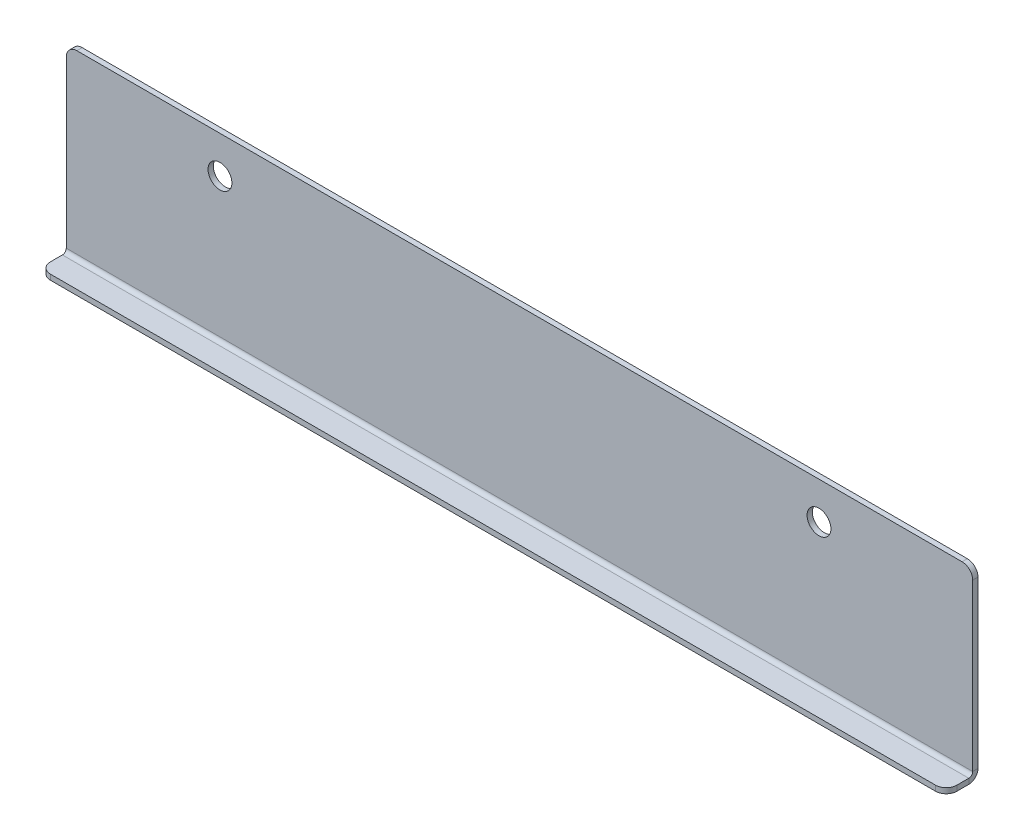
ISO-10303-21;
HEADER;
FILE_DESCRIPTION(('STEP AP214'),'2;1');
FILE_NAME('part.step','',(''),(''),'','','');
FILE_SCHEMA(('AUTOMOTIVE_DESIGN { 1 0 10303 214 1 1 1 1 }'));
ENDSEC;
DATA;
#1=APPLICATION_CONTEXT('core data for automotive mechanical design processes');
#2=APPLICATION_PROTOCOL_DEFINITION('international standard','automotive_design',2000,#1);
#3=PRODUCT_CONTEXT('',#1,'mechanical');
#4=PRODUCT('Part','Part','',(#3));
#5=PRODUCT_RELATED_PRODUCT_CATEGORY('part','',(#4));
#6=PRODUCT_DEFINITION_FORMATION('','',#4);
#7=PRODUCT_DEFINITION_CONTEXT('part definition',#1,'design');
#8=PRODUCT_DEFINITION('design','',#6,#7);
#9=PRODUCT_DEFINITION_SHAPE('','',#8);
#10=(LENGTH_UNIT() NAMED_UNIT(*) SI_UNIT(.MILLI.,.METRE.));
#11=(NAMED_UNIT(*) PLANE_ANGLE_UNIT() SI_UNIT($,.RADIAN.));
#12=(NAMED_UNIT(*) SI_UNIT($,.STERADIAN.) SOLID_ANGLE_UNIT());
#13=UNCERTAINTY_MEASURE_WITH_UNIT(LENGTH_MEASURE(1.E-05),#10,'distance_accuracy_value','');
#14=(GEOMETRIC_REPRESENTATION_CONTEXT(3) GLOBAL_UNCERTAINTY_ASSIGNED_CONTEXT((#13)) GLOBAL_UNIT_ASSIGNED_CONTEXT((#10,
#11,#12)) REPRESENTATION_CONTEXT('',''));
#15=CARTESIAN_POINT('',(0.,0.,0.));
#16=DIRECTION('',(0.,0.,1.));
#17=DIRECTION('',(1.,0.,0.));
#18=AXIS2_PLACEMENT_3D('',#15,#16,#17);
#19=CARTESIAN_POINT('',(85.4999999999999,-20.,-1.));
#20=DIRECTION('',(1.,0.,0.));
#21=DIRECTION('',(0.,0.,-1.));
#22=AXIS2_PLACEMENT_3D('',#19,#20,#21);
#23=PLANE('',#22);
#24=DIRECTION('',(0.,1.,0.));
#25=VECTOR('',#24,1.);
#26=CARTESIAN_POINT('',(85.4999999999999,-20.,-1.));
#27=LINE('',#26,#25);
#28=CARTESIAN_POINT('',(85.4999999999999,-19.2634,-1.));
#29=VERTEX_POINT('',#28);
#30=CARTESIAN_POINT('',(85.4999999999999,12.,-1.));
#31=VERTEX_POINT('',#30);
#32=EDGE_CURVE('E204',#29,#31,#27,.T.);
#33=ORIENTED_EDGE('',*,*,#32,.T.);
#34=DIRECTION('',(0.,0.,1.));
#35=VECTOR('',#34,1.);
#36=CARTESIAN_POINT('',(85.4999999999999,12.,-1.));
#37=LINE('',#36,#35);
#38=CARTESIAN_POINT('',(85.4999999999999,12.,0.));
#39=VERTEX_POINT('',#38);
#40=EDGE_CURVE('E234',#31,#39,#37,.T.);
#41=ORIENTED_EDGE('',*,*,#40,.T.);
#42=DIRECTION('',(0.,1.,0.));
#43=VECTOR('',#42,1.);
#44=CARTESIAN_POINT('',(85.4999999999999,-20.,0.));
#45=LINE('',#44,#43);
#46=CARTESIAN_POINT('',(85.4999999999999,-19.2634,0.));
#47=VERTEX_POINT('',#46);
#48=EDGE_CURVE('E201',#47,#39,#45,.T.);
#49=ORIENTED_EDGE('',*,*,#48,.F.);
#50=DIRECTION('',(0.,0.,-1.));
#51=VECTOR('',#50,1.);
#52=CARTESIAN_POINT('',(85.4999999999999,-19.2634,0.));
#53=LINE('',#52,#51);
#54=EDGE_CURVE('E179',#47,#29,#53,.T.);
#55=ORIENTED_EDGE('',*,*,#54,.T.);
#56=EDGE_LOOP('',(#33,#41,#49,#55));
#57=FACE_BOUND('',#56,.T.);
#58=ADVANCED_FACE('F45',(#57),#23,.T.);
#59=CARTESIAN_POINT('',(0.,0.,-1.));
#60=DIRECTION('',(0.,0.,-1.));
#61=DIRECTION('',(-1.,0.,0.));
#62=AXIS2_PLACEMENT_3D('',#59,#60,#61);
#63=PLANE('',#62);
#64=CARTESIAN_POINT('',(56.5000000000001,7.00000000000001,-1.));
#65=DIRECTION('',(0.,0.,1.));
#66=DIRECTION('',(-1.,0.,0.));
#67=AXIS2_PLACEMENT_3D('',#64,#65,#66);
#68=CIRCLE('',#67,2.25);
#69=CARTESIAN_POINT('',(54.2500000000001,7.00000000000001,-1.));
#70=VERTEX_POINT('',#69);
#71=EDGE_CURVE('E192',#70,#70,#68,.T.);
#72=ORIENTED_EDGE('',*,*,#71,.T.);
#73=EDGE_LOOP('',(#72));
#74=FACE_BOUND('',#73,.T.);
#75=CARTESIAN_POINT('',(-56.5000000000001,7.00000000000001,-1.));
#76=DIRECTION('',(0.,0.,1.));
#77=DIRECTION('',(1.,0.,0.));
#78=AXIS2_PLACEMENT_3D('',#75,#76,#77);
#79=CIRCLE('',#78,2.25);
#80=CARTESIAN_POINT('',(-54.2500000000001,7.00000000000001,-1.));
#81=VERTEX_POINT('',#80);
#82=EDGE_CURVE('E198',#81,#81,#79,.T.);
#83=ORIENTED_EDGE('',*,*,#82,.T.);
#84=EDGE_LOOP('',(#83));
#85=FACE_BOUND('',#84,.T.);
#86=DIRECTION('',(0.,-1.,0.));
#87=VECTOR('',#86,1.);
#88=CARTESIAN_POINT('',(-85.5000000000001,-20.,-1.));
#89=LINE('',#88,#87);
#90=CARTESIAN_POINT('',(-85.5000000000001,12.,-1.));
#91=VERTEX_POINT('',#90);
#92=CARTESIAN_POINT('',(-85.5000000000001,-19.2634,-1.));
#93=VERTEX_POINT('',#92);
#94=EDGE_CURVE('E211',#91,#93,#89,.T.);
#95=ORIENTED_EDGE('',*,*,#94,.F.);
#96=CARTESIAN_POINT('',(-83.5000000000001,12.,-1.));
#97=DIRECTION('',(0.,0.,-1.));
#98=DIRECTION('',(-1.,0.,0.));
#99=AXIS2_PLACEMENT_3D('',#96,#97,#98);
#100=CIRCLE('',#99,2.);
#101=CARTESIAN_POINT('',(-83.5000000000001,14.,-1.));
#102=VERTEX_POINT('',#101);
#103=EDGE_CURVE('E232',#91,#102,#100,.T.);
#104=ORIENTED_EDGE('',*,*,#103,.T.);
#105=DIRECTION('',(-1.,0.,0.));
#106=VECTOR('',#105,1.);
#107=CARTESIAN_POINT('',(-85.5000000000001,14.,-1.));
#108=LINE('',#107,#106);
#109=CARTESIAN_POINT('',(83.4999999999999,14.,-1.));
#110=VERTEX_POINT('',#109);
#111=EDGE_CURVE('E207',#110,#102,#108,.T.);
#112=ORIENTED_EDGE('',*,*,#111,.F.);
#113=CARTESIAN_POINT('',(83.4999999999999,12.,-1.));
#114=DIRECTION('',(0.,0.,-1.));
#115=DIRECTION('',(-1.,0.,0.));
#116=AXIS2_PLACEMENT_3D('',#113,#114,#115);
#117=CIRCLE('',#116,2.);
#118=EDGE_CURVE('E230',#110,#31,#117,.T.);
#119=ORIENTED_EDGE('',*,*,#118,.T.);
#120=ORIENTED_EDGE('',*,*,#32,.F.);
#121=DIRECTION('',(1.,0.,0.));
#122=VECTOR('',#121,1.);
#123=CARTESIAN_POINT('',(85.4999999999999,-19.2634,-1.));
#124=LINE('',#123,#122);
#125=EDGE_CURVE('E145',#29,#93,#124,.F.);
#126=ORIENTED_EDGE('',*,*,#125,.T.);
#127=EDGE_LOOP('',(#95,#104,#112,#119,#120,#126));
#128=FACE_BOUND('',#127,.T.);
#129=ADVANCED_FACE('F299',(#74,#85,#128),#63,.T.);
#130=CARTESIAN_POINT('',(0.,0.,0.));
#131=DIRECTION('',(0.,0.,-1.));
#132=DIRECTION('',(-1.,0.,0.));
#133=AXIS2_PLACEMENT_3D('',#130,#131,#132);
#134=PLANE('',#133);
#135=CARTESIAN_POINT('',(-56.5000000000001,7.00000000000001,0.));
#136=DIRECTION('',(0.,0.,1.));
#137=DIRECTION('',(1.,0.,0.));
#138=AXIS2_PLACEMENT_3D('',#135,#136,#137);
#139=CIRCLE('',#138,2.25);
#140=CARTESIAN_POINT('',(-54.2500000000001,7.00000000000001,0.));
#141=VERTEX_POINT('',#140);
#142=EDGE_CURVE('E195',#141,#141,#139,.T.);
#143=ORIENTED_EDGE('',*,*,#142,.F.);
#144=EDGE_LOOP('',(#143));
#145=FACE_BOUND('',#144,.T.);
#146=CARTESIAN_POINT('',(56.5000000000001,7.00000000000001,0.));
#147=DIRECTION('',(0.,0.,1.));
#148=DIRECTION('',(-1.,0.,0.));
#149=AXIS2_PLACEMENT_3D('',#146,#147,#148);
#150=CIRCLE('',#149,2.25);
#151=CARTESIAN_POINT('',(54.2500000000001,7.00000000000001,0.));
#152=VERTEX_POINT('',#151);
#153=EDGE_CURVE('E190',#152,#152,#150,.T.);
#154=ORIENTED_EDGE('',*,*,#153,.F.);
#155=EDGE_LOOP('',(#154));
#156=FACE_BOUND('',#155,.T.);
#157=DIRECTION('',(-1.,0.,0.));
#158=VECTOR('',#157,1.);
#159=CARTESIAN_POINT('',(-85.5000000000001,14.,0.));
#160=LINE('',#159,#158);
#161=CARTESIAN_POINT('',(83.4999999999999,14.,0.));
#162=VERTEX_POINT('',#161);
#163=CARTESIAN_POINT('',(-83.5000000000001,14.,0.));
#164=VERTEX_POINT('',#163);
#165=EDGE_CURVE('E216',#162,#164,#160,.T.);
#166=ORIENTED_EDGE('',*,*,#165,.T.);
#167=CARTESIAN_POINT('',(-83.5000000000001,12.,0.));
#168=DIRECTION('',(0.,0.,-1.));
#169=DIRECTION('',(-1.,0.,0.));
#170=AXIS2_PLACEMENT_3D('',#167,#168,#169);
#171=CIRCLE('',#170,2.);
#172=CARTESIAN_POINT('',(-85.5000000000001,12.,0.));
#173=VERTEX_POINT('',#172);
#174=EDGE_CURVE('E226',#164,#173,#171,.F.);
#175=ORIENTED_EDGE('',*,*,#174,.T.);
#176=DIRECTION('',(0.,-1.,0.));
#177=VECTOR('',#176,1.);
#178=CARTESIAN_POINT('',(-85.5000000000001,-20.,0.));
#179=LINE('',#178,#177);
#180=CARTESIAN_POINT('',(-85.5000000000001,-19.2634,0.));
#181=VERTEX_POINT('',#180);
#182=EDGE_CURVE('E208',#173,#181,#179,.T.);
#183=ORIENTED_EDGE('',*,*,#182,.T.);
#184=DIRECTION('',(1.,0.,0.));
#185=VECTOR('',#184,1.);
#186=CARTESIAN_POINT('',(85.4999999999999,-19.2634,0.));
#187=LINE('',#186,#185);
#188=EDGE_CURVE('E183',#47,#181,#187,.F.);
#189=ORIENTED_EDGE('',*,*,#188,.F.);
#190=ORIENTED_EDGE('',*,*,#48,.T.);
#191=CARTESIAN_POINT('',(83.4999999999999,12.,0.));
#192=DIRECTION('',(0.,0.,-1.));
#193=DIRECTION('',(-1.,0.,0.));
#194=AXIS2_PLACEMENT_3D('',#191,#192,#193);
#195=CIRCLE('',#194,2.);
#196=EDGE_CURVE('E224',#39,#162,#195,.F.);
#197=ORIENTED_EDGE('',*,*,#196,.T.);
#198=EDGE_LOOP('',(#166,#175,#183,#189,#190,#197));
#199=FACE_BOUND('',#198,.T.);
#200=ADVANCED_FACE('F277',(#145,#156,#199),#134,.F.);
#201=CARTESIAN_POINT('',(-85.5000000000001,-20.,-1.));
#202=DIRECTION('',(-1.,0.,0.));
#203=DIRECTION('',(0.,0.,1.));
#204=AXIS2_PLACEMENT_3D('',#201,#202,#203);
#205=PLANE('',#204);
#206=ORIENTED_EDGE('',*,*,#182,.F.);
#207=DIRECTION('',(0.,0.,1.));
#208=VECTOR('',#207,1.);
#209=CARTESIAN_POINT('',(-85.5000000000001,12.,-1.));
#210=LINE('',#209,#208);
#211=EDGE_CURVE('E228',#173,#91,#210,.F.);
#212=ORIENTED_EDGE('',*,*,#211,.T.);
#213=ORIENTED_EDGE('',*,*,#94,.T.);
#214=DIRECTION('',(0.,0.,-1.));
#215=VECTOR('',#214,1.);
#216=CARTESIAN_POINT('',(-85.5000000000001,-19.2634,0.));
#217=LINE('',#216,#215);
#218=EDGE_CURVE('E187',#181,#93,#217,.T.);
#219=ORIENTED_EDGE('',*,*,#218,.F.);
#220=EDGE_LOOP('',(#206,#212,#213,#219));
#221=FACE_BOUND('',#220,.T.);
#222=ADVANCED_FACE('F296',(#221),#205,.T.);
#223=CARTESIAN_POINT('',(-85.5000000000001,14.,-1.));
#224=DIRECTION('',(0.,1.,0.));
#225=DIRECTION('',(-1.,0.,0.));
#226=AXIS2_PLACEMENT_3D('',#223,#224,#225);
#227=PLANE('',#226);
#228=ORIENTED_EDGE('',*,*,#111,.T.);
#229=DIRECTION('',(0.,0.,1.));
#230=VECTOR('',#229,1.);
#231=CARTESIAN_POINT('',(-83.5000000000001,14.,-1.));
#232=LINE('',#231,#230);
#233=EDGE_CURVE('E221',#102,#164,#232,.T.);
#234=ORIENTED_EDGE('',*,*,#233,.T.);
#235=ORIENTED_EDGE('',*,*,#165,.F.);
#236=DIRECTION('',(0.,0.,1.));
#237=VECTOR('',#236,1.);
#238=CARTESIAN_POINT('',(83.4999999999999,14.,-1.));
#239=LINE('',#238,#237);
#240=EDGE_CURVE('E213',#162,#110,#239,.F.);
#241=ORIENTED_EDGE('',*,*,#240,.T.);
#242=EDGE_LOOP('',(#228,#234,#235,#241));
#243=FACE_BOUND('',#242,.T.);
#244=ADVANCED_FACE('F288',(#243),#227,.T.);
#245=CARTESIAN_POINT('',(-56.5000000000001,7.00000000000001,-1.));
#246=DIRECTION('',(0.,0.,1.));
#247=DIRECTION('',(1.,0.,0.));
#248=AXIS2_PLACEMENT_3D('',#245,#246,#247);
#249=CYLINDRICAL_SURFACE('',#248,2.25);
#250=ORIENTED_EDGE('',*,*,#82,.F.);
#251=EDGE_LOOP('',(#250));
#252=FACE_BOUND('',#251,.T.);
#253=ORIENTED_EDGE('',*,*,#142,.T.);
#254=EDGE_LOOP('',(#253));
#255=FACE_BOUND('',#254,.T.);
#256=ADVANCED_FACE('F312',(#252,#255),#249,.F.);
#257=CARTESIAN_POINT('',(56.5000000000001,7.00000000000001,-1.));
#258=DIRECTION('',(0.,0.,1.));
#259=DIRECTION('',(1.,0.,0.));
#260=AXIS2_PLACEMENT_3D('',#257,#258,#259);
#261=CYLINDRICAL_SURFACE('',#260,2.25);
#262=ORIENTED_EDGE('',*,*,#71,.F.);
#263=EDGE_LOOP('',(#262));
#264=FACE_BOUND('',#263,.T.);
#265=ORIENTED_EDGE('',*,*,#153,.T.);
#266=EDGE_LOOP('',(#265));
#267=FACE_BOUND('',#266,.T.);
#268=ADVANCED_FACE('F417',(#264,#267),#261,.F.);
#269=CARTESIAN_POINT('',(-85.5000000000001,-19.2634,0.736599999999997));
#270=DIRECTION('',(-1.,0.,0.));
#271=DIRECTION('',(0.,0.,1.));
#272=AXIS2_PLACEMENT_3D('',#269,#270,#271);
#273=PLANE('',#272);
#274=DIRECTION('',(0.,-1.,0.));
#275=VECTOR('',#274,1.);
#276=CARTESIAN_POINT('',(-85.5000000000001,-20.,0.736599999999997));
#277=LINE('',#276,#275);
#278=CARTESIAN_POINT('',(-85.5000000000001,-20.,0.736599999999994));
#279=VERTEX_POINT('',#278);
#280=CARTESIAN_POINT('',(-85.5000000000001,-21.,0.736599999999991));
#281=VERTEX_POINT('',#280);
#282=EDGE_CURVE('E266',#279,#281,#277,.T.);
#283=ORIENTED_EDGE('',*,*,#282,.F.);
#284=CARTESIAN_POINT('',(-85.5000000000001,-19.2634,0.736599999999997));
#285=DIRECTION('',(1.,0.,0.));
#286=DIRECTION('',(0.,0.,-1.));
#287=AXIS2_PLACEMENT_3D('',#284,#285,#286);
#288=CIRCLE('',#287,0.736600000000011);
#289=EDGE_CURVE('E148',#181,#279,#288,.F.);
#290=ORIENTED_EDGE('',*,*,#289,.F.);
#291=ORIENTED_EDGE('',*,*,#218,.T.);
#292=CARTESIAN_POINT('',(-85.5000000000001,-19.2634,0.736599999999997));
#293=DIRECTION('',(1.,0.,0.));
#294=DIRECTION('',(0.,0.,-1.));
#295=AXIS2_PLACEMENT_3D('',#292,#293,#294);
#296=CIRCLE('',#295,1.73660000000001);
#297=EDGE_CURVE('E178',#93,#281,#296,.F.);
#298=ORIENTED_EDGE('',*,*,#297,.T.);
#299=EDGE_LOOP('',(#283,#290,#291,#298));
#300=FACE_BOUND('',#299,.T.);
#301=ADVANCED_FACE('F271',(#300),#273,.T.);
#302=CARTESIAN_POINT('',(85.4999999999999,-19.2634,0.736600000000009));
#303=DIRECTION('',(-1.,0.,0.));
#304=DIRECTION('',(0.,0.,1.));
#305=AXIS2_PLACEMENT_3D('',#302,#303,#304);
#306=PLANE('',#305);
#307=CARTESIAN_POINT('',(85.4999999999999,-19.2634,0.736600000000009));
#308=DIRECTION('',(1.,0.,0.));
#309=DIRECTION('',(0.,0.,-1.));
#310=AXIS2_PLACEMENT_3D('',#307,#308,#309);
#311=CIRCLE('',#310,0.736600000000011);
#312=CARTESIAN_POINT('',(85.4999999999999,-20.,0.736600000000007));
#313=VERTEX_POINT('',#312);
#314=EDGE_CURVE('E155',#313,#47,#311,.T.);
#315=ORIENTED_EDGE('',*,*,#314,.F.);
#316=DIRECTION('',(0.,-1.,0.));
#317=VECTOR('',#316,1.);
#318=CARTESIAN_POINT('',(85.4999999999999,-20.,0.736600000000004));
#319=LINE('',#318,#317);
#320=CARTESIAN_POINT('',(85.4999999999999,-21.,0.7366));
#321=VERTEX_POINT('',#320);
#322=EDGE_CURVE('E152',#313,#321,#319,.T.);
#323=ORIENTED_EDGE('',*,*,#322,.T.);
#324=CARTESIAN_POINT('',(85.4999999999999,-19.2634,0.736600000000009));
#325=DIRECTION('',(1.,0.,0.));
#326=DIRECTION('',(0.,0.,-1.));
#327=AXIS2_PLACEMENT_3D('',#324,#325,#326);
#328=CIRCLE('',#327,1.73660000000001);
#329=EDGE_CURVE('E137',#321,#29,#328,.T.);
#330=ORIENTED_EDGE('',*,*,#329,.T.);
#331=ORIENTED_EDGE('',*,*,#54,.F.);
#332=EDGE_LOOP('',(#315,#323,#330,#331));
#333=FACE_BOUND('',#332,.T.);
#334=ADVANCED_FACE('F153',(#333),#306,.F.);
#335=CARTESIAN_POINT('',(85.4999999999999,-19.2634,0.736600000000009));
#336=DIRECTION('',(1.,0.,0.));
#337=DIRECTION('',(0.,-1.,0.));
#338=AXIS2_PLACEMENT_3D('',#335,#336,#337);
#339=CYLINDRICAL_SURFACE('',#338,1.73660000000001);
#340=ORIENTED_EDGE('',*,*,#125,.F.);
#341=ORIENTED_EDGE('',*,*,#329,.F.);
#342=DIRECTION('',(-1.,0.,0.));
#343=VECTOR('',#342,1.);
#344=CARTESIAN_POINT('',(0.,-21.,0.736599999999997));
#345=LINE('',#344,#343);
#346=EDGE_CURVE('E142',#321,#281,#345,.T.);
#347=ORIENTED_EDGE('',*,*,#346,.T.);
#348=ORIENTED_EDGE('',*,*,#297,.F.);
#349=EDGE_LOOP('',(#340,#341,#347,#348));
#350=FACE_BOUND('',#349,.T.);
#351=ADVANCED_FACE('F139',(#350),#339,.T.);
#352=CARTESIAN_POINT('',(85.4999999999999,-19.2634,0.736600000000009));
#353=DIRECTION('',(1.,0.,0.));
#354=DIRECTION('',(0.,-1.,0.));
#355=AXIS2_PLACEMENT_3D('',#352,#353,#354);
#356=CYLINDRICAL_SURFACE('',#355,0.736600000000011);
#357=ORIENTED_EDGE('',*,*,#188,.T.);
#358=ORIENTED_EDGE('',*,*,#289,.T.);
#359=DIRECTION('',(1.,0.,0.));
#360=VECTOR('',#359,1.);
#361=CARTESIAN_POINT('',(-85.5000000000001,-20.,0.736599999999997));
#362=LINE('',#361,#360);
#363=EDGE_CURVE('E157',#279,#313,#362,.T.);
#364=ORIENTED_EDGE('',*,*,#363,.T.);
#365=ORIENTED_EDGE('',*,*,#314,.T.);
#366=EDGE_LOOP('',(#357,#358,#364,#365));
#367=FACE_BOUND('',#366,.T.);
#368=ADVANCED_FACE('F273',(#367),#356,.F.);
#369=CARTESIAN_POINT('',(-85.5000000000001,-21.,0.));
#370=DIRECTION('',(1.,0.,0.));
#371=DIRECTION('',(0.,1.,0.));
#372=AXIS2_PLACEMENT_3D('',#369,#370,#371);
#373=PLANE('',#372);
#374=DIRECTION('',(0.,0.,-1.));
#375=VECTOR('',#374,1.);
#376=CARTESIAN_POINT('',(-85.5000000000001,-21.,0.));
#377=LINE('',#376,#375);
#378=CARTESIAN_POINT('',(-85.5000000000001,-21.,3.));
#379=VERTEX_POINT('',#378);
#380=EDGE_CURVE('E162',#379,#281,#377,.T.);
#381=ORIENTED_EDGE('',*,*,#380,.F.);
#382=DIRECTION('',(0.,1.,0.));
#383=VECTOR('',#382,1.);
#384=CARTESIAN_POINT('',(-85.5000000000001,-21.,3.));
#385=LINE('',#384,#383);
#386=CARTESIAN_POINT('',(-85.5000000000001,-20.,3.));
#387=VERTEX_POINT('',#386);
#388=EDGE_CURVE('E11',#379,#387,#385,.T.);
#389=ORIENTED_EDGE('',*,*,#388,.T.);
#390=DIRECTION('',(0.,0.,-1.));
#391=VECTOR('',#390,1.);
#392=CARTESIAN_POINT('',(-85.5000000000001,-20.,0.));
#393=LINE('',#392,#391);
#394=EDGE_CURVE('E163',#387,#279,#393,.T.);
#395=ORIENTED_EDGE('',*,*,#394,.T.);
#396=ORIENTED_EDGE('',*,*,#282,.T.);
#397=EDGE_LOOP('',(#381,#389,#395,#396));
#398=FACE_BOUND('',#397,.T.);
#399=ADVANCED_FACE('F262',(#398),#373,.F.);
#400=CARTESIAN_POINT('',(85.4999999999999,-21.,5.));
#401=DIRECTION('',(-1.,0.,0.));
#402=DIRECTION('',(0.,-1.,0.));
#403=AXIS2_PLACEMENT_3D('',#400,#401,#402);
#404=PLANE('',#403);
#405=DIRECTION('',(0.,0.,1.));
#406=VECTOR('',#405,1.);
#407=CARTESIAN_POINT('',(85.4999999999999,-20.,5.));
#408=LINE('',#407,#406);
#409=CARTESIAN_POINT('',(85.4999999999999,-20.,3.));
#410=VERTEX_POINT('',#409);
#411=EDGE_CURVE('E173',#313,#410,#408,.T.);
#412=ORIENTED_EDGE('',*,*,#411,.T.);
#413=DIRECTION('',(0.,1.,0.));
#414=VECTOR('',#413,1.);
#415=CARTESIAN_POINT('',(85.4999999999999,-21.,3.));
#416=LINE('',#415,#414);
#417=CARTESIAN_POINT('',(85.4999999999999,-21.,3.));
#418=VERTEX_POINT('',#417);
#419=EDGE_CURVE('E68',#410,#418,#416,.F.);
#420=ORIENTED_EDGE('',*,*,#419,.T.);
#421=DIRECTION('',(0.,0.,1.));
#422=VECTOR('',#421,1.);
#423=CARTESIAN_POINT('',(85.4999999999999,-21.,5.));
#424=LINE('',#423,#422);
#425=EDGE_CURVE('E160',#321,#418,#424,.T.);
#426=ORIENTED_EDGE('',*,*,#425,.F.);
#427=ORIENTED_EDGE('',*,*,#322,.F.);
#428=EDGE_LOOP('',(#412,#420,#426,#427));
#429=FACE_BOUND('',#428,.T.);
#430=ADVANCED_FACE('F165',(#429),#404,.F.);
#431=CARTESIAN_POINT('',(0.,-21.,0.));
#432=DIRECTION('',(0.,1.,0.));
#433=DIRECTION('',(0.,0.,1.));
#434=AXIS2_PLACEMENT_3D('',#431,#432,#433);
#435=PLANE('',#434);
#436=ORIENTED_EDGE('',*,*,#425,.T.);
#437=CARTESIAN_POINT('',(83.4999999999999,-21.,3.));
#438=DIRECTION('',(0.,1.,0.));
#439=DIRECTION('',(0.,0.,1.));
#440=AXIS2_PLACEMENT_3D('',#437,#438,#439);
#441=CIRCLE('',#440,2.);
#442=CARTESIAN_POINT('',(83.4999999999999,-21.,5.));
#443=VERTEX_POINT('',#442);
#444=EDGE_CURVE('E53',#418,#443,#441,.F.);
#445=ORIENTED_EDGE('',*,*,#444,.T.);
#446=DIRECTION('',(-1.,0.,0.));
#447=VECTOR('',#446,1.);
#448=CARTESIAN_POINT('',(-85.5000000000001,-21.,5.));
#449=LINE('',#448,#447);
#450=CARTESIAN_POINT('',(-83.5000000000001,-21.,5.));
#451=VERTEX_POINT('',#450);
#452=EDGE_CURVE('E166',#443,#451,#449,.T.);
#453=ORIENTED_EDGE('',*,*,#452,.T.);
#454=CARTESIAN_POINT('',(-83.5000000000001,-21.,3.));
#455=DIRECTION('',(0.,1.,0.));
#456=DIRECTION('',(0.,0.,1.));
#457=AXIS2_PLACEMENT_3D('',#454,#455,#456);
#458=CIRCLE('',#457,2.);
#459=EDGE_CURVE('E60',#451,#379,#458,.F.);
#460=ORIENTED_EDGE('',*,*,#459,.T.);
#461=ORIENTED_EDGE('',*,*,#380,.T.);
#462=ORIENTED_EDGE('',*,*,#346,.F.);
#463=EDGE_LOOP('',(#436,#445,#453,#460,#461,#462));
#464=FACE_BOUND('',#463,.T.);
#465=ADVANCED_FACE('F159',(#464),#435,.F.);
#466=CARTESIAN_POINT('',(0.,-20.,0.));
#467=DIRECTION('',(0.,1.,0.));
#468=DIRECTION('',(0.,0.,1.));
#469=AXIS2_PLACEMENT_3D('',#466,#467,#468);
#470=PLANE('',#469);
#471=DIRECTION('',(-1.,0.,0.));
#472=VECTOR('',#471,1.);
#473=CARTESIAN_POINT('',(-85.5000000000001,-20.,5.));
#474=LINE('',#473,#472);
#475=CARTESIAN_POINT('',(83.4999999999999,-20.,5.));
#476=VERTEX_POINT('',#475);
#477=CARTESIAN_POINT('',(-83.5000000000001,-20.,5.));
#478=VERTEX_POINT('',#477);
#479=EDGE_CURVE('E169',#476,#478,#474,.T.);
#480=ORIENTED_EDGE('',*,*,#479,.F.);
#481=CARTESIAN_POINT('',(83.4999999999999,-20.,3.));
#482=DIRECTION('',(0.,1.,0.));
#483=DIRECTION('',(0.,0.,1.));
#484=AXIS2_PLACEMENT_3D('',#481,#482,#483);
#485=CIRCLE('',#484,2.);
#486=EDGE_CURVE('E244',#476,#410,#485,.T.);
#487=ORIENTED_EDGE('',*,*,#486,.T.);
#488=ORIENTED_EDGE('',*,*,#411,.F.);
#489=ORIENTED_EDGE('',*,*,#363,.F.);
#490=ORIENTED_EDGE('',*,*,#394,.F.);
#491=CARTESIAN_POINT('',(-83.5000000000001,-20.,3.));
#492=DIRECTION('',(0.,1.,0.));
#493=DIRECTION('',(0.,0.,1.));
#494=AXIS2_PLACEMENT_3D('',#491,#492,#493);
#495=CIRCLE('',#494,2.);
#496=EDGE_CURVE('E242',#387,#478,#495,.T.);
#497=ORIENTED_EDGE('',*,*,#496,.T.);
#498=EDGE_LOOP('',(#480,#487,#488,#489,#490,#497));
#499=FACE_BOUND('',#498,.T.);
#500=ADVANCED_FACE('F256',(#499),#470,.T.);
#501=CARTESIAN_POINT('',(-85.5000000000001,-21.,5.));
#502=DIRECTION('',(0.,0.,-1.));
#503=DIRECTION('',(0.,1.,0.));
#504=AXIS2_PLACEMENT_3D('',#501,#502,#503);
#505=PLANE('',#504);
#506=ORIENTED_EDGE('',*,*,#452,.F.);
#507=DIRECTION('',(0.,1.,0.));
#508=VECTOR('',#507,1.);
#509=CARTESIAN_POINT('',(83.4999999999999,-21.,5.));
#510=LINE('',#509,#508);
#511=EDGE_CURVE('E239',#443,#476,#510,.T.);
#512=ORIENTED_EDGE('',*,*,#511,.T.);
#513=ORIENTED_EDGE('',*,*,#479,.T.);
#514=DIRECTION('',(0.,1.,0.));
#515=VECTOR('',#514,1.);
#516=CARTESIAN_POINT('',(-83.5000000000001,-21.,5.));
#517=LINE('',#516,#515);
#518=EDGE_CURVE('E237',#478,#451,#517,.F.);
#519=ORIENTED_EDGE('',*,*,#518,.T.);
#520=EDGE_LOOP('',(#506,#512,#513,#519));
#521=FACE_BOUND('',#520,.T.);
#522=ADVANCED_FACE('F251',(#521),#505,.F.);
#523=CARTESIAN_POINT('',(-83.5000000000001,12.,-1.));
#524=DIRECTION('',(0.,0.,1.));
#525=DIRECTION('',(1.,0.,0.));
#526=AXIS2_PLACEMENT_3D('',#523,#524,#525);
#527=CYLINDRICAL_SURFACE('',#526,2.);
#528=ORIENTED_EDGE('',*,*,#103,.F.);
#529=ORIENTED_EDGE('',*,*,#211,.F.);
#530=ORIENTED_EDGE('',*,*,#174,.F.);
#531=ORIENTED_EDGE('',*,*,#233,.F.);
#532=EDGE_LOOP('',(#528,#529,#530,#531));
#533=FACE_BOUND('',#532,.T.);
#534=ADVANCED_FACE('F293',(#533),#527,.T.);
#535=CARTESIAN_POINT('',(83.4999999999999,12.,-1.));
#536=DIRECTION('',(0.,0.,1.));
#537=DIRECTION('',(1.,0.,0.));
#538=AXIS2_PLACEMENT_3D('',#535,#536,#537);
#539=CYLINDRICAL_SURFACE('',#538,2.);
#540=ORIENTED_EDGE('',*,*,#118,.F.);
#541=ORIENTED_EDGE('',*,*,#240,.F.);
#542=ORIENTED_EDGE('',*,*,#196,.F.);
#543=ORIENTED_EDGE('',*,*,#40,.F.);
#544=EDGE_LOOP('',(#540,#541,#542,#543));
#545=FACE_BOUND('',#544,.T.);
#546=ADVANCED_FACE('F284',(#545),#539,.T.);
#547=CARTESIAN_POINT('',(83.4999999999999,-21.,3.));
#548=DIRECTION('',(0.,1.,0.));
#549=DIRECTION('',(0.,0.,1.));
#550=AXIS2_PLACEMENT_3D('',#547,#548,#549);
#551=CYLINDRICAL_SURFACE('',#550,2.);
#552=ORIENTED_EDGE('',*,*,#444,.F.);
#553=ORIENTED_EDGE('',*,*,#419,.F.);
#554=ORIENTED_EDGE('',*,*,#486,.F.);
#555=ORIENTED_EDGE('',*,*,#511,.F.);
#556=EDGE_LOOP('',(#552,#553,#554,#555));
#557=FACE_BOUND('',#556,.T.);
#558=ADVANCED_FACE('F254',(#557),#551,.T.);
#559=CARTESIAN_POINT('',(-83.5000000000001,-21.,3.));
#560=DIRECTION('',(0.,1.,0.));
#561=DIRECTION('',(0.,0.,1.));
#562=AXIS2_PLACEMENT_3D('',#559,#560,#561);
#563=CYLINDRICAL_SURFACE('',#562,2.);
#564=ORIENTED_EDGE('',*,*,#459,.F.);
#565=ORIENTED_EDGE('',*,*,#518,.F.);
#566=ORIENTED_EDGE('',*,*,#496,.F.);
#567=ORIENTED_EDGE('',*,*,#388,.F.);
#568=EDGE_LOOP('',(#564,#565,#566,#567));
#569=FACE_BOUND('',#568,.T.);
#570=ADVANCED_FACE('F47',(#569),#563,.T.);
#571=CLOSED_SHELL('',(#58,#129,#200,#222,#244,#256,#268,#301,#334,#351,#368,#399,#430,#465,#500,
#522,#534,#546,#558,#570));
#572=MANIFOLD_SOLID_BREP('B2',#571);
#573=ADVANCED_BREP_SHAPE_REPRESENTATION('',(#18,#572),#14);
#574=SHAPE_DEFINITION_REPRESENTATION(#9,#573);
ENDSEC;
END-ISO-10303-21;
